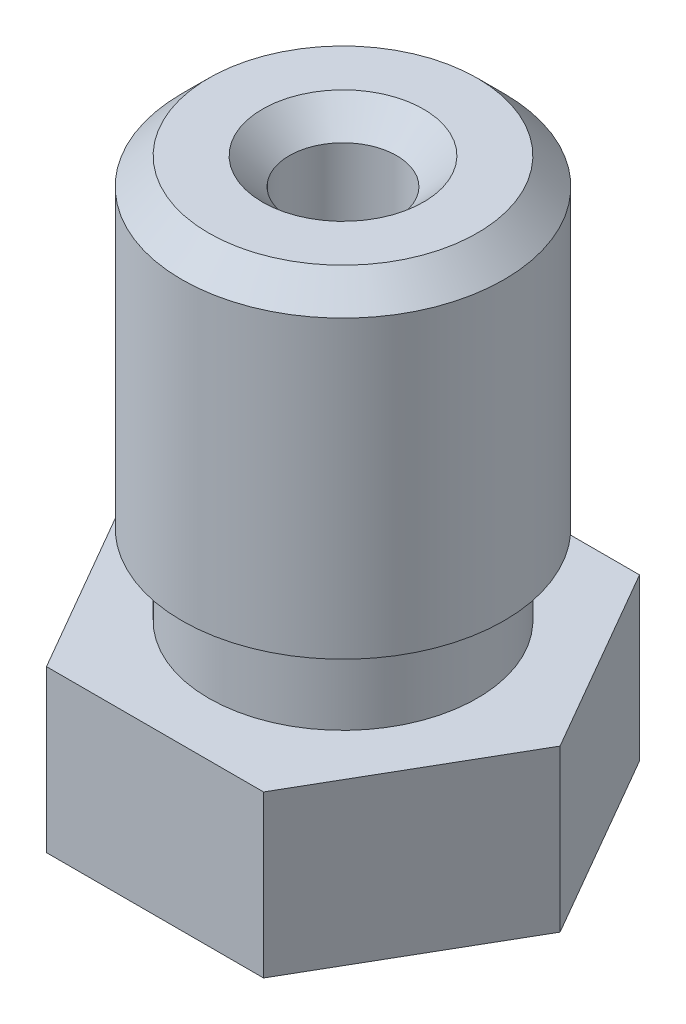
ISO-10303-21;
HEADER;
FILE_DESCRIPTION(('STEP AP214'),'2;1');
FILE_NAME('part.step','',(''),(''),'','','');
FILE_SCHEMA(('AUTOMOTIVE_DESIGN { 1 0 10303 214 1 1 1 1 }'));
ENDSEC;
DATA;
#1=APPLICATION_CONTEXT('core data for automotive mechanical design processes');
#2=APPLICATION_PROTOCOL_DEFINITION('international standard','automotive_design',2000,#1);
#3=PRODUCT_CONTEXT('',#1,'mechanical');
#4=PRODUCT('Part','Part','',(#3));
#5=PRODUCT_RELATED_PRODUCT_CATEGORY('part','',(#4));
#6=PRODUCT_DEFINITION_FORMATION('','',#4);
#7=PRODUCT_DEFINITION_CONTEXT('part definition',#1,'design');
#8=PRODUCT_DEFINITION('design','',#6,#7);
#9=PRODUCT_DEFINITION_SHAPE('','',#8);
#10=(LENGTH_UNIT() NAMED_UNIT(*) SI_UNIT(.MILLI.,.METRE.));
#11=(NAMED_UNIT(*) PLANE_ANGLE_UNIT() SI_UNIT($,.RADIAN.));
#12=(NAMED_UNIT(*) SI_UNIT($,.STERADIAN.) SOLID_ANGLE_UNIT());
#13=UNCERTAINTY_MEASURE_WITH_UNIT(LENGTH_MEASURE(1.E-05),#10,'distance_accuracy_value','');
#14=(GEOMETRIC_REPRESENTATION_CONTEXT(3) GLOBAL_UNCERTAINTY_ASSIGNED_CONTEXT((#13)) GLOBAL_UNIT_ASSIGNED_CONTEXT((#10,
#11,#12)) REPRESENTATION_CONTEXT('',''));
#15=CARTESIAN_POINT('',(0.,0.,0.));
#16=DIRECTION('',(0.,0.,1.));
#17=DIRECTION('',(1.,0.,0.));
#18=AXIS2_PLACEMENT_3D('',#15,#16,#17);
#19=CARTESIAN_POINT('',(2.02072594216369,3.,3.5));
#20=DIRECTION('',(0.,0.,1.));
#21=DIRECTION('',(1.,0.,0.));
#22=AXIS2_PLACEMENT_3D('',#19,#20,#21);
#23=PLANE('',#22);
#24=DIRECTION('',(-1.,0.,0.));
#25=VECTOR('',#24,1.);
#26=CARTESIAN_POINT('',(2.02072594216369,0.,3.5));
#27=LINE('',#26,#25);
#28=CARTESIAN_POINT('',(2.02072594216369,0.,3.5));
#29=VERTEX_POINT('',#28);
#30=CARTESIAN_POINT('',(-2.02072594216369,0.,3.5));
#31=VERTEX_POINT('',#30);
#32=EDGE_CURVE('E121',#29,#31,#27,.T.);
#33=ORIENTED_EDGE('',*,*,#32,.F.);
#34=DIRECTION('',(0.,-1.,0.));
#35=VECTOR('',#34,1.);
#36=CARTESIAN_POINT('',(2.02072594216369,3.,3.5));
#37=LINE('',#36,#35);
#38=CARTESIAN_POINT('',(2.02072594216369,3.,3.5));
#39=VERTEX_POINT('',#38);
#40=EDGE_CURVE('E50',#39,#29,#37,.T.);
#41=ORIENTED_EDGE('',*,*,#40,.F.);
#42=DIRECTION('',(-1.,0.,0.));
#43=VECTOR('',#42,1.);
#44=CARTESIAN_POINT('',(2.02072594216369,3.,3.5));
#45=LINE('',#44,#43);
#46=CARTESIAN_POINT('',(-2.02072594216369,3.,3.5));
#47=VERTEX_POINT('',#46);
#48=EDGE_CURVE('E137',#39,#47,#45,.T.);
#49=ORIENTED_EDGE('',*,*,#48,.T.);
#50=DIRECTION('',(0.,-1.,0.));
#51=VECTOR('',#50,1.);
#52=CARTESIAN_POINT('',(-2.02072594216369,3.,3.5));
#53=LINE('',#52,#51);
#54=EDGE_CURVE('E85',#47,#31,#53,.T.);
#55=ORIENTED_EDGE('',*,*,#54,.T.);
#56=EDGE_LOOP('',(#33,#41,#49,#55));
#57=FACE_BOUND('',#56,.T.);
#58=ADVANCED_FACE('F33',(#57),#23,.T.);
#59=CARTESIAN_POINT('',(4.04145188432738,3.,0.));
#60=DIRECTION('',(0.866025403784439,0.,0.5));
#61=DIRECTION('',(0.5,0.,-0.866025403784439));
#62=AXIS2_PLACEMENT_3D('',#59,#60,#61);
#63=PLANE('',#62);
#64=DIRECTION('',(-0.5,0.,0.866025403784439));
#65=VECTOR('',#64,1.);
#66=CARTESIAN_POINT('',(4.04145188432738,0.,0.));
#67=LINE('',#66,#65);
#68=CARTESIAN_POINT('',(4.04145188432738,0.,0.));
#69=VERTEX_POINT('',#68);
#70=EDGE_CURVE('E134',#69,#29,#67,.T.);
#71=ORIENTED_EDGE('',*,*,#70,.F.);
#72=DIRECTION('',(0.,-1.,0.));
#73=VECTOR('',#72,1.);
#74=CARTESIAN_POINT('',(4.04145188432738,3.,0.));
#75=LINE('',#74,#73);
#76=CARTESIAN_POINT('',(4.04145188432738,3.,0.));
#77=VERTEX_POINT('',#76);
#78=EDGE_CURVE('E73',#77,#69,#75,.T.);
#79=ORIENTED_EDGE('',*,*,#78,.F.);
#80=DIRECTION('',(-0.5,0.,0.866025403784439));
#81=VECTOR('',#80,1.);
#82=CARTESIAN_POINT('',(4.04145188432738,3.,0.));
#83=LINE('',#82,#81);
#84=EDGE_CURVE('E111',#77,#39,#83,.T.);
#85=ORIENTED_EDGE('',*,*,#84,.T.);
#86=ORIENTED_EDGE('',*,*,#40,.T.);
#87=EDGE_LOOP('',(#71,#79,#85,#86));
#88=FACE_BOUND('',#87,.T.);
#89=ADVANCED_FACE('F210',(#88),#63,.T.);
#90=CARTESIAN_POINT('',(2.02072594216369,3.,-3.5));
#91=DIRECTION('',(0.866025403784438,0.,-0.500000000000001));
#92=DIRECTION('',(-0.500000000000001,0.,-0.866025403784438));
#93=AXIS2_PLACEMENT_3D('',#90,#91,#92);
#94=PLANE('',#93);
#95=DIRECTION('',(0.500000000000001,0.,0.866025403784438));
#96=VECTOR('',#95,1.);
#97=CARTESIAN_POINT('',(2.02072594216369,0.,-3.5));
#98=LINE('',#97,#96);
#99=CARTESIAN_POINT('',(2.02072594216369,0.,-3.5));
#100=VERTEX_POINT('',#99);
#101=EDGE_CURVE('E98',#100,#69,#98,.T.);
#102=ORIENTED_EDGE('',*,*,#101,.F.);
#103=DIRECTION('',(0.,-1.,0.));
#104=VECTOR('',#103,1.);
#105=CARTESIAN_POINT('',(2.02072594216369,3.,-3.5));
#106=LINE('',#105,#104);
#107=CARTESIAN_POINT('',(2.02072594216369,3.,-3.5));
#108=VERTEX_POINT('',#107);
#109=EDGE_CURVE('E93',#108,#100,#106,.T.);
#110=ORIENTED_EDGE('',*,*,#109,.F.);
#111=DIRECTION('',(0.500000000000001,0.,0.866025403784438));
#112=VECTOR('',#111,1.);
#113=CARTESIAN_POINT('',(2.02072594216369,3.,-3.5));
#114=LINE('',#113,#112);
#115=EDGE_CURVE('E96',#108,#77,#114,.T.);
#116=ORIENTED_EDGE('',*,*,#115,.T.);
#117=ORIENTED_EDGE('',*,*,#78,.T.);
#118=EDGE_LOOP('',(#102,#110,#116,#117));
#119=FACE_BOUND('',#118,.T.);
#120=ADVANCED_FACE('F95',(#119),#94,.T.);
#121=CARTESIAN_POINT('',(-2.02072594216369,3.,-3.5));
#122=DIRECTION('',(0.,0.,-1.));
#123=DIRECTION('',(-1.,0.,0.));
#124=AXIS2_PLACEMENT_3D('',#121,#122,#123);
#125=PLANE('',#124);
#126=DIRECTION('',(1.,0.,0.));
#127=VECTOR('',#126,1.);
#128=CARTESIAN_POINT('',(-2.02072594216369,0.,-3.5));
#129=LINE('',#128,#127);
#130=CARTESIAN_POINT('',(-2.02072594216369,0.,-3.5));
#131=VERTEX_POINT('',#130);
#132=EDGE_CURVE('E131',#131,#100,#129,.T.);
#133=ORIENTED_EDGE('',*,*,#132,.F.);
#134=DIRECTION('',(0.,-1.,0.));
#135=VECTOR('',#134,1.);
#136=CARTESIAN_POINT('',(-2.02072594216369,3.,-3.5));
#137=LINE('',#136,#135);
#138=CARTESIAN_POINT('',(-2.02072594216369,3.,-3.5));
#139=VERTEX_POINT('',#138);
#140=EDGE_CURVE('E103',#139,#131,#137,.T.);
#141=ORIENTED_EDGE('',*,*,#140,.F.);
#142=DIRECTION('',(1.,0.,0.));
#143=VECTOR('',#142,1.);
#144=CARTESIAN_POINT('',(-2.02072594216369,3.,-3.5));
#145=LINE('',#144,#143);
#146=EDGE_CURVE('E109',#139,#108,#145,.T.);
#147=ORIENTED_EDGE('',*,*,#146,.T.);
#148=ORIENTED_EDGE('',*,*,#109,.T.);
#149=EDGE_LOOP('',(#133,#141,#147,#148));
#150=FACE_BOUND('',#149,.T.);
#151=ADVANCED_FACE('F113',(#150),#125,.T.);
#152=CARTESIAN_POINT('',(-4.04145188432738,3.,0.));
#153=DIRECTION('',(-0.866025403784439,0.,-0.5));
#154=DIRECTION('',(-0.5,0.,0.866025403784439));
#155=AXIS2_PLACEMENT_3D('',#152,#153,#154);
#156=PLANE('',#155);
#157=DIRECTION('',(0.5,0.,-0.866025403784439));
#158=VECTOR('',#157,1.);
#159=CARTESIAN_POINT('',(-4.04145188432738,0.,0.));
#160=LINE('',#159,#158);
#161=CARTESIAN_POINT('',(-4.04145188432738,0.,0.));
#162=VERTEX_POINT('',#161);
#163=EDGE_CURVE('E128',#162,#131,#160,.T.);
#164=ORIENTED_EDGE('',*,*,#163,.F.);
#165=DIRECTION('',(0.,-1.,0.));
#166=VECTOR('',#165,1.);
#167=CARTESIAN_POINT('',(-4.04145188432738,3.,0.));
#168=LINE('',#167,#166);
#169=CARTESIAN_POINT('',(-4.04145188432738,3.,0.));
#170=VERTEX_POINT('',#169);
#171=EDGE_CURVE('E142',#170,#162,#168,.T.);
#172=ORIENTED_EDGE('',*,*,#171,.F.);
#173=DIRECTION('',(0.5,0.,-0.866025403784439));
#174=VECTOR('',#173,1.);
#175=CARTESIAN_POINT('',(-4.04145188432738,3.,0.));
#176=LINE('',#175,#174);
#177=EDGE_CURVE('E114',#170,#139,#176,.T.);
#178=ORIENTED_EDGE('',*,*,#177,.T.);
#179=ORIENTED_EDGE('',*,*,#140,.T.);
#180=EDGE_LOOP('',(#164,#172,#178,#179));
#181=FACE_BOUND('',#180,.T.);
#182=ADVANCED_FACE('F224',(#181),#156,.T.);
#183=CARTESIAN_POINT('',(-2.02072594216369,3.,3.5));
#184=DIRECTION('',(-0.866025403784439,0.,0.5));
#185=DIRECTION('',(0.5,0.,0.866025403784439));
#186=AXIS2_PLACEMENT_3D('',#183,#184,#185);
#187=PLANE('',#186);
#188=DIRECTION('',(-0.5,0.,-0.866025403784439));
#189=VECTOR('',#188,1.);
#190=CARTESIAN_POINT('',(-2.02072594216369,0.,3.5));
#191=LINE('',#190,#189);
#192=EDGE_CURVE('E124',#31,#162,#191,.T.);
#193=ORIENTED_EDGE('',*,*,#192,.F.);
#194=ORIENTED_EDGE('',*,*,#54,.F.);
#195=DIRECTION('',(-0.5,0.,-0.866025403784439));
#196=VECTOR('',#195,1.);
#197=CARTESIAN_POINT('',(-2.02072594216369,3.,3.5));
#198=LINE('',#197,#196);
#199=EDGE_CURVE('E116',#47,#170,#198,.T.);
#200=ORIENTED_EDGE('',*,*,#199,.T.);
#201=ORIENTED_EDGE('',*,*,#171,.T.);
#202=EDGE_LOOP('',(#193,#194,#200,#201));
#203=FACE_BOUND('',#202,.T.);
#204=ADVANCED_FACE('F206',(#203),#187,.T.);
#205=CARTESIAN_POINT('',(0.,3.,0.));
#206=DIRECTION('',(0.,-1.,0.));
#207=DIRECTION('',(0.,0.,-1.));
#208=AXIS2_PLACEMENT_3D('',#205,#206,#207);
#209=PLANE('',#208);
#210=CARTESIAN_POINT('',(0.,3.,0.));
#211=DIRECTION('',(0.,1.,0.));
#212=DIRECTION('',(0.,0.,1.));
#213=AXIS2_PLACEMENT_3D('',#210,#211,#212);
#214=CIRCLE('',#213,2.5);
#215=CARTESIAN_POINT('',(0.,3.,2.5));
#216=VERTEX_POINT('',#215);
#217=EDGE_CURVE('E125',#216,#216,#214,.T.);
#218=ORIENTED_EDGE('',*,*,#217,.F.);
#219=EDGE_LOOP('',(#218));
#220=FACE_BOUND('',#219,.T.);
#221=ORIENTED_EDGE('',*,*,#48,.F.);
#222=ORIENTED_EDGE('',*,*,#84,.F.);
#223=ORIENTED_EDGE('',*,*,#115,.F.);
#224=ORIENTED_EDGE('',*,*,#146,.F.);
#225=ORIENTED_EDGE('',*,*,#177,.F.);
#226=ORIENTED_EDGE('',*,*,#199,.F.);
#227=EDGE_LOOP('',(#221,#222,#223,#224,#225,#226));
#228=FACE_BOUND('',#227,.T.);
#229=ADVANCED_FACE('F107',(#220,#228),#209,.F.);
#230=CARTESIAN_POINT('',(0.,0.,0.));
#231=DIRECTION('',(0.,-1.,0.));
#232=DIRECTION('',(0.,0.,-1.));
#233=AXIS2_PLACEMENT_3D('',#230,#231,#232);
#234=PLANE('',#233);
#235=CARTESIAN_POINT('',(0.,0.,0.));
#236=DIRECTION('',(0.,-1.,0.));
#237=DIRECTION('',(0.,0.,-1.));
#238=AXIS2_PLACEMENT_3D('',#235,#236,#237);
#239=CIRCLE('',#238,2.50000000004502);
#240=CARTESIAN_POINT('',(0.,0.,-2.50000000004502));
#241=VERTEX_POINT('',#240);
#242=EDGE_CURVE('E139',#241,#241,#239,.T.);
#243=ORIENTED_EDGE('',*,*,#242,.F.);
#244=EDGE_LOOP('',(#243));
#245=FACE_BOUND('',#244,.T.);
#246=ORIENTED_EDGE('',*,*,#32,.T.);
#247=ORIENTED_EDGE('',*,*,#192,.T.);
#248=ORIENTED_EDGE('',*,*,#163,.T.);
#249=ORIENTED_EDGE('',*,*,#132,.T.);
#250=ORIENTED_EDGE('',*,*,#101,.T.);
#251=ORIENTED_EDGE('',*,*,#70,.T.);
#252=EDGE_LOOP('',(#246,#247,#248,#249,#250,#251));
#253=FACE_BOUND('',#252,.T.);
#254=ADVANCED_FACE('F209',(#245,#253),#234,.T.);
#255=CARTESIAN_POINT('',(0.,3.,0.));
#256=DIRECTION('',(0.,1.,0.));
#257=DIRECTION('',(0.,0.,1.));
#258=AXIS2_PLACEMENT_3D('',#255,#256,#257);
#259=CYLINDRICAL_SURFACE('',#258,2.5);
#260=ORIENTED_EDGE('',*,*,#217,.T.);
#261=EDGE_LOOP('',(#260));
#262=FACE_BOUND('',#261,.T.);
#263=CARTESIAN_POINT('',(0.,4.5,0.));
#264=DIRECTION('',(0.,1.,0.));
#265=DIRECTION('',(0.,0.,1.));
#266=AXIS2_PLACEMENT_3D('',#263,#264,#265);
#267=CIRCLE('',#266,2.5);
#268=CARTESIAN_POINT('',(0.,4.5,2.5));
#269=VERTEX_POINT('',#268);
#270=EDGE_CURVE('E198',#269,#269,#267,.T.);
#271=ORIENTED_EDGE('',*,*,#270,.F.);
#272=EDGE_LOOP('',(#271));
#273=FACE_BOUND('',#272,.T.);
#274=ADVANCED_FACE('F167',(#262,#273),#259,.T.);
#275=CARTESIAN_POINT('',(0.,10.5,0.));
#276=DIRECTION('',(0.,1.,0.));
#277=DIRECTION('',(0.,0.,1.));
#278=AXIS2_PLACEMENT_3D('',#275,#276,#277);
#279=PLANE('',#278);
#280=CARTESIAN_POINT('',(0.,10.5,0.));
#281=DIRECTION('',(0.,1.,0.));
#282=DIRECTION('',(0.,0.,1.));
#283=AXIS2_PLACEMENT_3D('',#280,#281,#282);
#284=CIRCLE('',#283,2.4999999999834);
#285=CARTESIAN_POINT('',(0.,10.5,2.4999999999834));
#286=VERTEX_POINT('',#285);
#287=EDGE_CURVE('E150',#286,#286,#284,.T.);
#288=ORIENTED_EDGE('',*,*,#287,.T.);
#289=EDGE_LOOP('',(#288));
#290=FACE_BOUND('',#289,.T.);
#291=CARTESIAN_POINT('',(-1.10963134903613E-11,10.5,0.));
#292=DIRECTION('',(0.,1.,0.));
#293=DIRECTION('',(0.,0.,1.));
#294=AXIS2_PLACEMENT_3D('',#291,#292,#293);
#295=CIRCLE('',#294,1.5000000000277);
#296=CARTESIAN_POINT('',(-1.10963134903613E-11,10.5,1.5000000000277));
#297=VERTEX_POINT('',#296);
#298=EDGE_CURVE('E147',#297,#297,#295,.F.);
#299=ORIENTED_EDGE('',*,*,#298,.T.);
#300=EDGE_LOOP('',(#299));
#301=FACE_BOUND('',#300,.T.);
#302=ADVANCED_FACE('F164',(#290,#301),#279,.T.);
#303=CARTESIAN_POINT('',(0.,3.,0.));
#304=DIRECTION('',(0.,1.,0.));
#305=DIRECTION('',(0.,0.,1.));
#306=AXIS2_PLACEMENT_3D('',#303,#304,#305);
#307=CYLINDRICAL_SURFACE('',#306,3.);
#308=CARTESIAN_POINT('',(0.,9.9999999999834,0.));
#309=DIRECTION('',(0.,1.,0.));
#310=DIRECTION('',(0.,0.,1.));
#311=AXIS2_PLACEMENT_3D('',#308,#309,#310);
#312=CIRCLE('',#311,3.);
#313=CARTESIAN_POINT('',(0.,9.9999999999834,3.));
#314=VERTEX_POINT('',#313);
#315=EDGE_CURVE('E42',#314,#314,#312,.F.);
#316=ORIENTED_EDGE('',*,*,#315,.T.);
#317=EDGE_LOOP('',(#316));
#318=FACE_BOUND('',#317,.T.);
#319=CARTESIAN_POINT('',(0.,4.5,0.));
#320=DIRECTION('',(0.,1.,0.));
#321=DIRECTION('',(0.,0.,1.));
#322=AXIS2_PLACEMENT_3D('',#319,#320,#321);
#323=CIRCLE('',#322,3.);
#324=CARTESIAN_POINT('',(0.,4.5,3.));
#325=VERTEX_POINT('',#324);
#326=EDGE_CURVE('E201',#325,#325,#323,.T.);
#327=ORIENTED_EDGE('',*,*,#326,.T.);
#328=EDGE_LOOP('',(#327));
#329=FACE_BOUND('',#328,.T.);
#330=ADVANCED_FACE('F155',(#318,#329),#307,.T.);
#331=CARTESIAN_POINT('',(3.,4.5,0.));
#332=DIRECTION('',(0.,-1.,0.));
#333=DIRECTION('',(0.,0.,-1.));
#334=AXIS2_PLACEMENT_3D('',#331,#332,#333);
#335=PLANE('',#334);
#336=ORIENTED_EDGE('',*,*,#270,.T.);
#337=EDGE_LOOP('',(#336));
#338=FACE_BOUND('',#337,.T.);
#339=ORIENTED_EDGE('',*,*,#326,.F.);
#340=EDGE_LOOP('',(#339));
#341=FACE_BOUND('',#340,.T.);
#342=ADVANCED_FACE('F244',(#338,#341),#335,.T.);
#343=CARTESIAN_POINT('',(0.,-2.,0.));
#344=DIRECTION('',(0.,1.,0.));
#345=DIRECTION('',(-1.,0.,0.));
#346=AXIS2_PLACEMENT_3D('',#343,#344,#345);
#347=CONICAL_SURFACE('',#346,0.50000000004502,0.785398163397449);
#348=ORIENTED_EDGE('',*,*,#242,.T.);
#349=EDGE_LOOP('',(#348));
#350=FACE_BOUND('',#349,.T.);
#351=CARTESIAN_POINT('',(0.,-2.,0.));
#352=DIRECTION('',(0.,-1.,0.));
#353=DIRECTION('',(1.,0.,0.));
#354=AXIS2_PLACEMENT_3D('',#351,#352,#353);
#355=CIRCLE('',#354,0.50000000004502);
#356=CARTESIAN_POINT('',(0.50000000004502,-2.,0.));
#357=VERTEX_POINT('',#356);
#358=EDGE_CURVE('E189',#357,#357,#355,.T.);
#359=ORIENTED_EDGE('',*,*,#358,.F.);
#360=EDGE_LOOP('',(#359));
#361=FACE_BOUND('',#360,.T.);
#362=ADVANCED_FACE('F247',(#350,#361),#347,.T.);
#363=CARTESIAN_POINT('',(0.,-2.,0.));
#364=DIRECTION('',(0.,-1.,0.));
#365=DIRECTION('',(1.,0.,0.));
#366=AXIS2_PLACEMENT_3D('',#363,#364,#365);
#367=PLANE('',#366);
#368=CARTESIAN_POINT('',(-1.10963134903613E-11,-2.,0.));
#369=DIRECTION('',(0.,1.,0.));
#370=DIRECTION('',(0.,0.,1.));
#371=AXIS2_PLACEMENT_3D('',#368,#369,#370);
#372=CIRCLE('',#371,0.3);
#373=CARTESIAN_POINT('',(-1.10963134903613E-11,-2.,0.3));
#374=VERTEX_POINT('',#373);
#375=EDGE_CURVE('E185',#374,#374,#372,.T.);
#376=ORIENTED_EDGE('',*,*,#375,.T.);
#377=EDGE_LOOP('',(#376));
#378=FACE_BOUND('',#377,.T.);
#379=ORIENTED_EDGE('',*,*,#358,.T.);
#380=EDGE_LOOP('',(#379));
#381=FACE_BOUND('',#380,.T.);
#382=ADVANCED_FACE('F251',(#378,#381),#367,.T.);
#383=CARTESIAN_POINT('',(-1.10963134903613E-11,-2.,0.));
#384=DIRECTION('',(0.,1.,0.));
#385=DIRECTION('',(0.,0.,1.));
#386=AXIS2_PLACEMENT_3D('',#383,#384,#385);
#387=CYLINDRICAL_SURFACE('',#386,0.3);
#388=ORIENTED_EDGE('',*,*,#375,.F.);
#389=EDGE_LOOP('',(#388));
#390=FACE_BOUND('',#389,.T.);
#391=CARTESIAN_POINT('',(-1.10963134903613E-11,-1.20000000003984,0.));
#392=DIRECTION('',(0.,1.,0.));
#393=DIRECTION('',(0.,0.,1.));
#394=AXIS2_PLACEMENT_3D('',#391,#392,#393);
#395=CIRCLE('',#394,0.3);
#396=CARTESIAN_POINT('',(-1.10963134903613E-11,-1.20000000003984,0.3));
#397=VERTEX_POINT('',#396);
#398=EDGE_CURVE('E273',#397,#397,#395,.T.);
#399=ORIENTED_EDGE('',*,*,#398,.T.);
#400=EDGE_LOOP('',(#399));
#401=FACE_BOUND('',#400,.T.);
#402=ADVANCED_FACE('F179',(#390,#401),#387,.F.);
#403=CARTESIAN_POINT('',(-1.10963134903613E-11,-2.,0.));
#404=DIRECTION('',(0.,1.,0.));
#405=DIRECTION('',(0.,0.,1.));
#406=AXIS2_PLACEMENT_3D('',#403,#404,#405);
#407=CYLINDRICAL_SURFACE('',#406,1.0000000000111);
#408=CARTESIAN_POINT('',(-1.10963134903613E-11,9.9999999999834,0.));
#409=DIRECTION('',(0.,1.,0.));
#410=DIRECTION('',(0.,0.,1.));
#411=AXIS2_PLACEMENT_3D('',#408,#409,#410);
#412=CIRCLE('',#411,1.0000000000111);
#413=CARTESIAN_POINT('',(-1.10963134903613E-11,9.9999999999834,1.0000000000111));
#414=VERTEX_POINT('',#413);
#415=EDGE_CURVE('E11',#414,#414,#412,.T.);
#416=ORIENTED_EDGE('',*,*,#415,.T.);
#417=EDGE_LOOP('',(#416));
#418=FACE_BOUND('',#417,.T.);
#419=CARTESIAN_POINT('',(-1.10963134903613E-11,0.,0.));
#420=DIRECTION('',(0.,1.,0.));
#421=DIRECTION('',(0.,0.,1.));
#422=AXIS2_PLACEMENT_3D('',#419,#420,#421);
#423=CIRCLE('',#422,1.0000000000111);
#424=CARTESIAN_POINT('',(-1.10963134903613E-11,0.,1.0000000000111));
#425=VERTEX_POINT('',#424);
#426=EDGE_CURVE('E183',#425,#425,#423,.T.);
#427=ORIENTED_EDGE('',*,*,#426,.F.);
#428=EDGE_LOOP('',(#427));
#429=FACE_BOUND('',#428,.T.);
#430=ADVANCED_FACE('F175',(#418,#429),#407,.F.);
#431=CARTESIAN_POINT('',(-1.10963134903613E-11,0.,0.));
#432=DIRECTION('',(0.,1.,0.));
#433=DIRECTION('',(0.,0.,1.));
#434=AXIS2_PLACEMENT_3D('',#431,#432,#433);
#435=CONICAL_SURFACE('',#434,1.0000000000111,0.832981266710198);
#436=CARTESIAN_POINT('',(-1.10963134903613E-11,-0.227272727272521,0.));
#437=DIRECTION('',(0.,1.,0.));
#438=DIRECTION('',(0.,0.,1.));
#439=AXIS2_PLACEMENT_3D('',#436,#437,#438);
#440=CIRCLE('',#439,0.749999999993361);
#441=CARTESIAN_POINT('',(-1.10963134903613E-11,-0.227272727272521,0.749999999993361));
#442=VERTEX_POINT('',#441);
#443=EDGE_CURVE('E186',#442,#442,#440,.T.);
#444=ORIENTED_EDGE('',*,*,#443,.F.);
#445=EDGE_LOOP('',(#444));
#446=FACE_BOUND('',#445,.T.);
#447=ORIENTED_EDGE('',*,*,#426,.T.);
#448=EDGE_LOOP('',(#447));
#449=FACE_BOUND('',#448,.T.);
#450=ADVANCED_FACE('F178',(#446,#449),#435,.F.);
#451=CARTESIAN_POINT('',(-1.10963134903613E-11,-2.,0.));
#452=DIRECTION('',(0.,1.,0.));
#453=DIRECTION('',(0.,0.,1.));
#454=AXIS2_PLACEMENT_3D('',#451,#452,#453);
#455=CYLINDRICAL_SURFACE('',#454,0.749999999993361);
#456=CARTESIAN_POINT('',(-1.10963134903613E-11,-0.700000000000002,0.));
#457=DIRECTION('',(0.,1.,0.));
#458=DIRECTION('',(0.,0.,1.));
#459=AXIS2_PLACEMENT_3D('',#456,#457,#458);
#460=CIRCLE('',#459,0.749999999993361);
#461=CARTESIAN_POINT('',(-1.10963134903613E-11,-0.700000000000002,0.749999999993361));
#462=VERTEX_POINT('',#461);
#463=EDGE_CURVE('E192',#462,#462,#460,.T.);
#464=ORIENTED_EDGE('',*,*,#463,.F.);
#465=EDGE_LOOP('',(#464));
#466=FACE_BOUND('',#465,.T.);
#467=ORIENTED_EDGE('',*,*,#443,.T.);
#468=EDGE_LOOP('',(#467));
#469=FACE_BOUND('',#468,.T.);
#470=ADVANCED_FACE('F261',(#466,#469),#455,.F.);
#471=CARTESIAN_POINT('',(-1.10963134903613E-11,-0.700000000000002,0.));
#472=DIRECTION('',(0.,1.,0.));
#473=DIRECTION('',(0.,0.,1.));
#474=AXIS2_PLACEMENT_3D('',#471,#472,#473);
#475=CONICAL_SURFACE('',#474,0.749999999993361,0.732815101739557);
#476=ORIENTED_EDGE('',*,*,#398,.F.);
#477=EDGE_LOOP('',(#476));
#478=FACE_BOUND('',#477,.T.);
#479=ORIENTED_EDGE('',*,*,#463,.T.);
#480=EDGE_LOOP('',(#479));
#481=FACE_BOUND('',#480,.T.);
#482=ADVANCED_FACE('F161',(#478,#481),#475,.F.);
#483=CARTESIAN_POINT('',(0.,10.5,0.));
#484=DIRECTION('',(0.,-1.,0.));
#485=DIRECTION('',(0.,0.,-1.));
#486=AXIS2_PLACEMENT_3D('',#483,#484,#485);
#487=CONICAL_SURFACE('',#486,2.4999999999834,0.785398163397446);
#488=ORIENTED_EDGE('',*,*,#315,.F.);
#489=EDGE_LOOP('',(#488));
#490=FACE_BOUND('',#489,.T.);
#491=ORIENTED_EDGE('',*,*,#287,.F.);
#492=EDGE_LOOP('',(#491));
#493=FACE_BOUND('',#492,.T.);
#494=ADVANCED_FACE('F158',(#490,#493),#487,.T.);
#495=CARTESIAN_POINT('',(-1.10963134903613E-11,9.9999999999834,0.));
#496=DIRECTION('',(0.,1.,0.));
#497=DIRECTION('',(0.,0.,1.));
#498=AXIS2_PLACEMENT_3D('',#495,#496,#497);
#499=CONICAL_SURFACE('',#498,1.0000000000111,0.785398163397452);
#500=ORIENTED_EDGE('',*,*,#298,.F.);
#501=EDGE_LOOP('',(#500));
#502=FACE_BOUND('',#501,.T.);
#503=ORIENTED_EDGE('',*,*,#415,.F.);
#504=EDGE_LOOP('',(#503));
#505=FACE_BOUND('',#504,.T.);
#506=ADVANCED_FACE('F35',(#502,#505),#499,.F.);
#507=CLOSED_SHELL('',(#58,#89,#120,#151,#182,#204,#229,#254,#274,#302,#330,#342,#362,#382,#402,
#430,#450,#470,#482,#494,#506));
#508=MANIFOLD_SOLID_BREP('B2',#507);
#509=ADVANCED_BREP_SHAPE_REPRESENTATION('',(#18,#508),#14);
#510=SHAPE_DEFINITION_REPRESENTATION(#9,#509);
ENDSEC;
END-ISO-10303-21;
